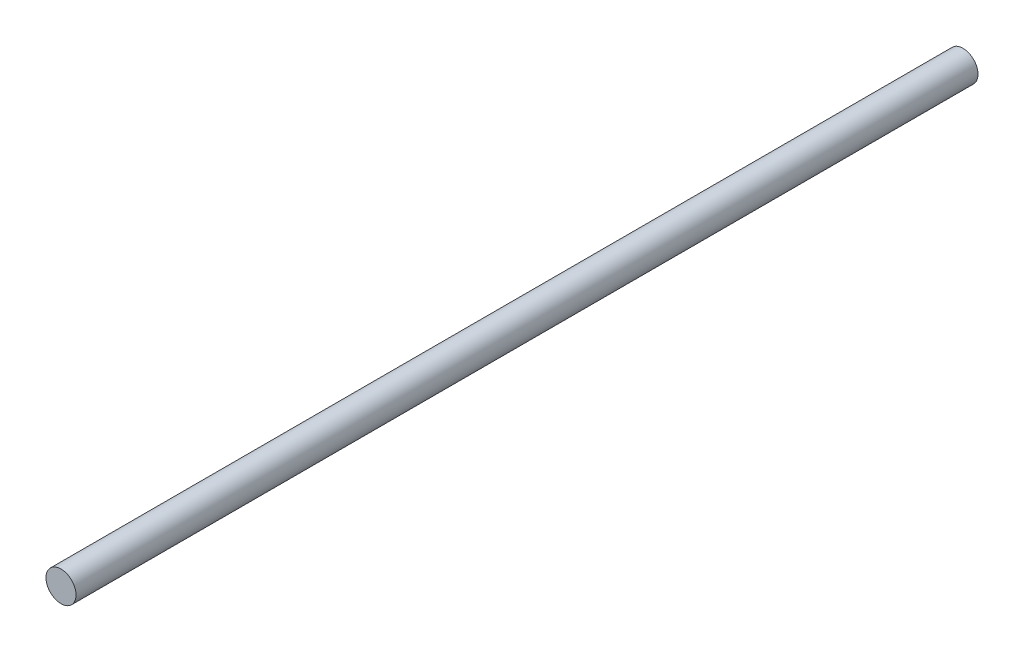
ISO-10303-21;
HEADER;
FILE_DESCRIPTION(('STEP AP214'),'2;1');
FILE_NAME('part.step','',(''),(''),'','','');
FILE_SCHEMA(('AUTOMOTIVE_DESIGN { 1 0 10303 214 1 1 1 1 }'));
ENDSEC;
DATA;
#1=APPLICATION_CONTEXT('core data for automotive mechanical design processes');
#2=APPLICATION_PROTOCOL_DEFINITION('international standard','automotive_design',2000,#1);
#3=PRODUCT_CONTEXT('',#1,'mechanical');
#4=PRODUCT('Part','Part','',(#3));
#5=PRODUCT_RELATED_PRODUCT_CATEGORY('part','',(#4));
#6=PRODUCT_DEFINITION_FORMATION('','',#4);
#7=PRODUCT_DEFINITION_CONTEXT('part definition',#1,'design');
#8=PRODUCT_DEFINITION('design','',#6,#7);
#9=PRODUCT_DEFINITION_SHAPE('','',#8);
#10=(LENGTH_UNIT() NAMED_UNIT(*) SI_UNIT(.MILLI.,.METRE.));
#11=(NAMED_UNIT(*) PLANE_ANGLE_UNIT() SI_UNIT($,.RADIAN.));
#12=(NAMED_UNIT(*) SI_UNIT($,.STERADIAN.) SOLID_ANGLE_UNIT());
#13=UNCERTAINTY_MEASURE_WITH_UNIT(LENGTH_MEASURE(1.E-05),#10,'distance_accuracy_value','');
#14=(GEOMETRIC_REPRESENTATION_CONTEXT(3) GLOBAL_UNCERTAINTY_ASSIGNED_CONTEXT((#13)) GLOBAL_UNIT_ASSIGNED_CONTEXT((#10,
#11,#12)) REPRESENTATION_CONTEXT('',''));
#15=CARTESIAN_POINT('',(0.,0.,0.));
#16=DIRECTION('',(0.,0.,1.));
#17=DIRECTION('',(1.,0.,0.));
#18=AXIS2_PLACEMENT_3D('',#15,#16,#17);
#19=CARTESIAN_POINT('',(0.,0.,38.1));
#20=DIRECTION('',(0.,0.,-1.));
#21=DIRECTION('',(-1.,0.,0.));
#22=AXIS2_PLACEMENT_3D('',#19,#20,#21);
#23=CYLINDRICAL_SURFACE('',#22,0.635);
#24=CARTESIAN_POINT('',(0.,0.,38.1));
#25=DIRECTION('',(0.,0.,1.));
#26=DIRECTION('',(1.,0.,0.));
#27=AXIS2_PLACEMENT_3D('',#24,#25,#26);
#28=CIRCLE('',#27,0.635);
#29=CARTESIAN_POINT('',(0.635,0.,38.1));
#30=VERTEX_POINT('',#29);
#31=EDGE_CURVE('E10',#30,#30,#28,.T.);
#32=ORIENTED_EDGE('',*,*,#31,.F.);
#33=EDGE_LOOP('',(#32));
#34=FACE_BOUND('',#33,.T.);
#35=CARTESIAN_POINT('',(0.,0.,0.));
#36=DIRECTION('',(0.,0.,1.));
#37=DIRECTION('',(1.,0.,0.));
#38=AXIS2_PLACEMENT_3D('',#35,#36,#37);
#39=CIRCLE('',#38,0.635);
#40=CARTESIAN_POINT('',(0.635,0.,0.));
#41=VERTEX_POINT('',#40);
#42=EDGE_CURVE('E40',#41,#41,#39,.T.);
#43=ORIENTED_EDGE('',*,*,#42,.T.);
#44=EDGE_LOOP('',(#43));
#45=FACE_BOUND('',#44,.T.);
#46=ADVANCED_FACE('F37',(#34,#45),#23,.T.);
#47=CARTESIAN_POINT('',(0.,0.,38.1));
#48=DIRECTION('',(0.,0.,1.));
#49=DIRECTION('',(1.,0.,0.));
#50=AXIS2_PLACEMENT_3D('',#47,#48,#49);
#51=PLANE('',#50);
#52=ORIENTED_EDGE('',*,*,#31,.T.);
#53=EDGE_LOOP('',(#52));
#54=FACE_BOUND('',#53,.T.);
#55=ADVANCED_FACE('F54',(#54),#51,.T.);
#56=CARTESIAN_POINT('',(0.,0.,0.));
#57=DIRECTION('',(0.,0.,1.));
#58=DIRECTION('',(1.,0.,0.));
#59=AXIS2_PLACEMENT_3D('',#56,#57,#58);
#60=PLANE('',#59);
#61=ORIENTED_EDGE('',*,*,#42,.F.);
#62=EDGE_LOOP('',(#61));
#63=FACE_BOUND('',#62,.T.);
#64=ADVANCED_FACE('F52',(#63),#60,.F.);
#65=CLOSED_SHELL('',(#46,#55,#64));
#66=MANIFOLD_SOLID_BREP('B2',#65);
#67=ADVANCED_BREP_SHAPE_REPRESENTATION('',(#18,#66),#14);
#68=SHAPE_DEFINITION_REPRESENTATION(#9,#67);
ENDSEC;
END-ISO-10303-21;
